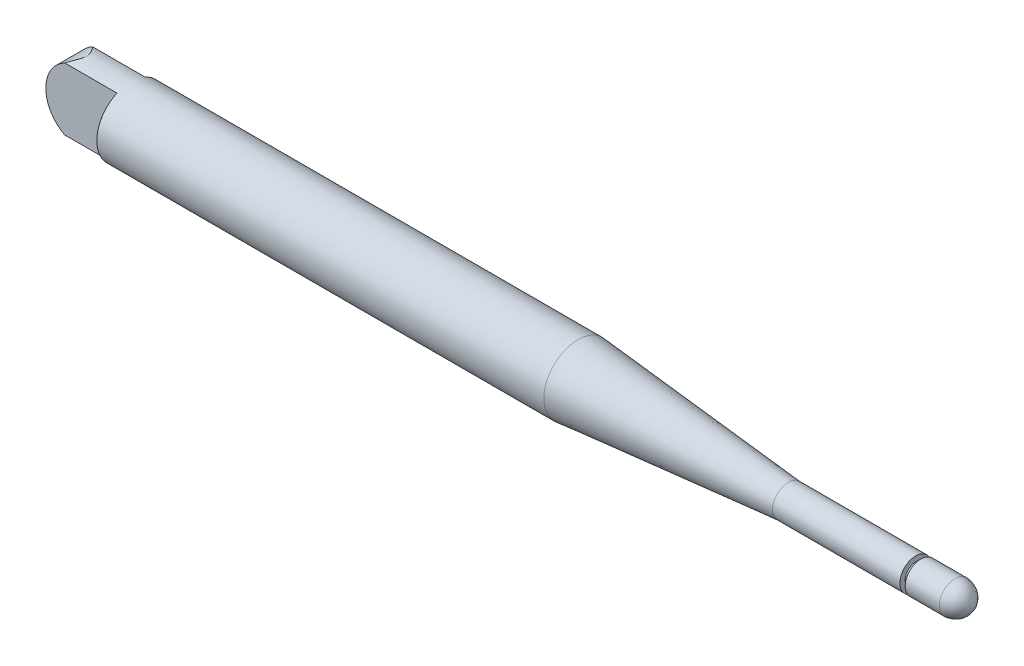
ISO-10303-21;
HEADER;
FILE_DESCRIPTION(('STEP AP214'),'2;1');
FILE_NAME('part.step','',(''),(''),'','','');
FILE_SCHEMA(('AUTOMOTIVE_DESIGN { 1 0 10303 214 1 1 1 1 }'));
ENDSEC;
DATA;
#1=APPLICATION_CONTEXT('core data for automotive mechanical design processes');
#2=APPLICATION_PROTOCOL_DEFINITION('international standard','automotive_design',2000,#1);
#3=PRODUCT_CONTEXT('',#1,'mechanical');
#4=PRODUCT('Part','Part','',(#3));
#5=PRODUCT_RELATED_PRODUCT_CATEGORY('part','',(#4));
#6=PRODUCT_DEFINITION_FORMATION('','',#4);
#7=PRODUCT_DEFINITION_CONTEXT('part definition',#1,'design');
#8=PRODUCT_DEFINITION('design','',#6,#7);
#9=PRODUCT_DEFINITION_SHAPE('','',#8);
#10=(LENGTH_UNIT() NAMED_UNIT(*) SI_UNIT(.MILLI.,.METRE.));
#11=(NAMED_UNIT(*) PLANE_ANGLE_UNIT() SI_UNIT($,.RADIAN.));
#12=(NAMED_UNIT(*) SI_UNIT($,.STERADIAN.) SOLID_ANGLE_UNIT());
#13=UNCERTAINTY_MEASURE_WITH_UNIT(LENGTH_MEASURE(1.E-05),#10,'distance_accuracy_value','');
#14=(GEOMETRIC_REPRESENTATION_CONTEXT(3) GLOBAL_UNCERTAINTY_ASSIGNED_CONTEXT((#13)) GLOBAL_UNIT_ASSIGNED_CONTEXT((#10,
#11,#12)) REPRESENTATION_CONTEXT('',''));
#15=CARTESIAN_POINT('',(0.,0.,0.));
#16=DIRECTION('',(0.,0.,1.));
#17=DIRECTION('',(1.,0.,0.));
#18=AXIS2_PLACEMENT_3D('',#15,#16,#17);
#19=CARTESIAN_POINT('',(-13.5,5.93134908875541,-2.65877753625991));
#20=DIRECTION('',(0.,0.,1.));
#21=DIRECTION('',(1.,0.,0.));
#22=AXIS2_PLACEMENT_3D('',#19,#20,#21);
#23=PLANE('',#22);
#24=DIRECTION('',(1.,0.,0.));
#25=VECTOR('',#24,1.);
#26=CARTESIAN_POINT('',(-13.5,-5.93134908875541,-2.65877753625991));
#27=LINE('',#26,#25);
#28=CARTESIAN_POINT('',(-9.96948914570237,-5.93134908875541,-2.65877753625991));
#29=VERTEX_POINT('',#28);
#30=CARTESIAN_POINT('',(0.,-5.93134908875541,-2.65877753625991));
#31=VERTEX_POINT('',#30);
#32=EDGE_CURVE('E114',#29,#31,#27,.T.);
#33=ORIENTED_EDGE('',*,*,#32,.F.);
#34=CARTESIAN_POINT('',(-6.84305441160065,-0.0116188090929386,-2.65877753625991));
#35=DIRECTION('',(0.,0.,1.));
#36=DIRECTION('',(1.,0.,0.));
#37=AXIS2_PLACEMENT_3D('',#34,#35,#36);
#38=CIRCLE('',#37,6.69460982661055);
#39=CARTESIAN_POINT('',(-13.5,-0.720756428769742,-2.65877753625991));
#40=VERTEX_POINT('',#39);
#41=EDGE_CURVE('E92',#29,#40,#38,.F.);
#42=ORIENTED_EDGE('',*,*,#41,.T.);
#43=DIRECTION('',(0.,-1.,0.));
#44=VECTOR('',#43,1.);
#45=CARTESIAN_POINT('',(-13.5,5.93134908875541,-2.65877753625991));
#46=LINE('',#45,#44);
#47=CARTESIAN_POINT('',(-13.5,0.697518810583865,-2.65877753625991));
#48=VERTEX_POINT('',#47);
#49=EDGE_CURVE('E154',#48,#40,#46,.T.);
#50=ORIENTED_EDGE('',*,*,#49,.F.);
#51=CARTESIAN_POINT('',(-9.92508836593899,5.93134908875541,-2.65877753625991));
#52=VERTEX_POINT('',#51);
#53=EDGE_CURVE('E58',#48,#52,#38,.F.);
#54=ORIENTED_EDGE('',*,*,#53,.T.);
#55=DIRECTION('',(1.,0.,0.));
#56=VECTOR('',#55,1.);
#57=CARTESIAN_POINT('',(-13.5,5.93134908875541,-2.65877753625991));
#58=LINE('',#57,#56);
#59=CARTESIAN_POINT('',(0.,5.93134908875541,-2.65877753625991));
#60=VERTEX_POINT('',#59);
#61=EDGE_CURVE('E117',#52,#60,#58,.T.);
#62=ORIENTED_EDGE('',*,*,#61,.T.);
#63=DIRECTION('',(0.,-1.,0.));
#64=VECTOR('',#63,1.);
#65=CARTESIAN_POINT('',(0.,5.93134908875541,-2.65877753625991));
#66=LINE('',#65,#64);
#67=EDGE_CURVE('E96',#60,#31,#66,.T.);
#68=ORIENTED_EDGE('',*,*,#67,.T.);
#69=EDGE_LOOP('',(#33,#42,#50,#54,#62,#68));
#70=FACE_BOUND('',#69,.T.);
#71=ADVANCED_FACE('F36',(#70),#23,.F.);
#72=CARTESIAN_POINT('',(-13.5,5.93134908875541,2.65877753625991));
#73=DIRECTION('',(0.,0.,-1.));
#74=DIRECTION('',(-1.,0.,0.));
#75=AXIS2_PLACEMENT_3D('',#72,#73,#74);
#76=PLANE('',#75);
#77=DIRECTION('',(0.,1.,0.));
#78=VECTOR('',#77,1.);
#79=CARTESIAN_POINT('',(-13.5,5.93134908875541,2.65877753625991));
#80=LINE('',#79,#78);
#81=CARTESIAN_POINT('',(-13.5,-0.720756428769742,2.65877753625991));
#82=VERTEX_POINT('',#81);
#83=CARTESIAN_POINT('',(-13.5,0.697518810583865,2.65877753625991));
#84=VERTEX_POINT('',#83);
#85=EDGE_CURVE('E106',#82,#84,#80,.T.);
#86=ORIENTED_EDGE('',*,*,#85,.F.);
#87=CARTESIAN_POINT('',(-6.84305441160065,-0.0116188090929386,2.65877753625991));
#88=DIRECTION('',(0.,0.,-1.));
#89=DIRECTION('',(1.,0.,0.));
#90=AXIS2_PLACEMENT_3D('',#87,#88,#89);
#91=CIRCLE('',#90,6.69460982661055);
#92=CARTESIAN_POINT('',(-9.96948914570237,-5.93134908875541,2.65877753625991));
#93=VERTEX_POINT('',#92);
#94=EDGE_CURVE('E50',#93,#82,#91,.T.);
#95=ORIENTED_EDGE('',*,*,#94,.F.);
#96=DIRECTION('',(1.,0.,0.));
#97=VECTOR('',#96,1.);
#98=CARTESIAN_POINT('',(-13.5,-5.93134908875541,2.65877753625991));
#99=LINE('',#98,#97);
#100=CARTESIAN_POINT('',(0.,-5.93134908875541,2.65877753625991));
#101=VERTEX_POINT('',#100);
#102=EDGE_CURVE('E102',#93,#101,#99,.T.);
#103=ORIENTED_EDGE('',*,*,#102,.T.);
#104=DIRECTION('',(0.,1.,0.));
#105=VECTOR('',#104,1.);
#106=CARTESIAN_POINT('',(0.,5.93134908875541,2.65877753625991));
#107=LINE('',#106,#105);
#108=CARTESIAN_POINT('',(0.,5.93134908875541,2.65877753625991));
#109=VERTEX_POINT('',#108);
#110=EDGE_CURVE('E152',#101,#109,#107,.T.);
#111=ORIENTED_EDGE('',*,*,#110,.T.);
#112=DIRECTION('',(1.,0.,0.));
#113=VECTOR('',#112,1.);
#114=CARTESIAN_POINT('',(-13.5,5.93134908875541,2.65877753625991));
#115=LINE('',#114,#113);
#116=CARTESIAN_POINT('',(-9.92508836593899,5.93134908875541,2.65877753625991));
#117=VERTEX_POINT('',#116);
#118=EDGE_CURVE('E115',#117,#109,#115,.T.);
#119=ORIENTED_EDGE('',*,*,#118,.F.);
#120=EDGE_CURVE('E107',#84,#117,#91,.T.);
#121=ORIENTED_EDGE('',*,*,#120,.F.);
#122=EDGE_LOOP('',(#86,#95,#103,#111,#119,#121));
#123=FACE_BOUND('',#122,.T.);
#124=ADVANCED_FACE('F100',(#123),#76,.F.);
#125=CARTESIAN_POINT('',(0.,0.,0.));
#126=DIRECTION('',(-1.,0.,0.));
#127=DIRECTION('',(0.,0.,1.));
#128=AXIS2_PLACEMENT_3D('',#125,#126,#127);
#129=PLANE('',#128);
#130=ORIENTED_EDGE('',*,*,#110,.F.);
#131=CARTESIAN_POINT('',(0.,0.,0.));
#132=DIRECTION('',(-1.,0.,0.));
#133=DIRECTION('',(0.,0.,1.));
#134=AXIS2_PLACEMENT_3D('',#131,#132,#133);
#135=CIRCLE('',#134,6.5);
#136=EDGE_CURVE('E113',#101,#109,#135,.T.);
#137=ORIENTED_EDGE('',*,*,#136,.T.);
#138=EDGE_LOOP('',(#130,#137));
#139=FACE_BOUND('',#138,.T.);
#140=ADVANCED_FACE('F184',(#139),#129,.T.);
#141=ORIENTED_EDGE('',*,*,#67,.F.);
#142=EDGE_CURVE('E144',#60,#31,#135,.T.);
#143=ORIENTED_EDGE('',*,*,#142,.T.);
#144=EDGE_LOOP('',(#141,#143));
#145=FACE_BOUND('',#144,.T.);
#146=ADVANCED_FACE('F38',(#145),#129,.T.);
#147=CARTESIAN_POINT('',(0.,0.,0.));
#148=DIRECTION('',(-1.,0.,0.));
#149=DIRECTION('',(0.,0.,1.));
#150=AXIS2_PLACEMENT_3D('',#147,#148,#149);
#151=CYLINDRICAL_SURFACE('',#150,6.5);
#152=CARTESIAN_POINT('',(-13.5,-0.720756428769742,-6.45991564731205));
#153=CARTESIAN_POINT('',(-13.4833574139441,-0.877342532267539,-6.44248218625441));
#154=CARTESIAN_POINT('',(-13.461191347965,-1.03263538821568,-6.41935608392167));
#155=CARTESIAN_POINT('',(-13.4065430399751,-1.33920836519285,-6.36244181702825));
#156=CARTESIAN_POINT('',(-13.3740737638005,-1.4904932720678,-6.32866705336982));
#157=CARTESIAN_POINT('',(-13.2998538947807,-1.78662912695314,-6.25149471674544));
#158=CARTESIAN_POINT('',(-13.2581931042841,-1.93152707361161,-6.20819026000292));
#159=CARTESIAN_POINT('',(-13.1662620898384,-2.21551154243796,-6.11260803921326));
#160=CARTESIAN_POINT('',(-13.1159894162341,-2.35459639702643,-6.06032772196795));
#161=CARTESIAN_POINT('',(-12.9541052172634,-2.76068327837173,-5.89186676166285));
#162=CARTESIAN_POINT('',(-12.8309828151993,-3.01822895862794,-5.76360494067673));
#163=CARTESIAN_POINT('',(-12.5605858404299,-3.50527130598998,-5.48112474872881));
#164=CARTESIAN_POINT('',(-12.4132534551716,-3.7346984800383,-5.32684422226666));
#165=CARTESIAN_POINT('',(-12.1387192822587,-4.11211952931791,-5.03808752415199));
#166=CARTESIAN_POINT('',(-12.0153663451483,-4.26633035371224,-4.90795269058228));
#167=CARTESIAN_POINT('',(-11.7604353579328,-4.55857190935269,-4.63778458124256));
#168=CARTESIAN_POINT('',(-11.6288532754372,-4.69659461143644,-4.49774644825907));
#169=CARTESIAN_POINT('',(-11.3590315742956,-4.95722793453934,-4.20878619776122));
#170=CARTESIAN_POINT('',(-11.2207714292513,-5.07978622234732,-4.0598363026082));
#171=CARTESIAN_POINT('',(-10.9398641211509,-5.30943421001304,-3.7545158029024));
#172=CARTESIAN_POINT('',(-10.7972185169717,-5.41652933110621,-3.59814782472558));
#173=CARTESIAN_POINT('',(-10.5048102139539,-5.61892857236999,-3.27343897059948));
#174=CARTESIAN_POINT('',(-10.354964727587,-5.71375639793204,-3.10487626419305));
#175=CARTESIAN_POINT('',(-10.0547993084868,-5.88806764260359,-2.76007718778379));
#176=CARTESIAN_POINT('',(-9.90447904432438,-5.96753499353082,-2.58383301598556));
#177=CARTESIAN_POINT('',(-9.60762943322177,-6.11094766764369,-2.22347978241912));
#178=CARTESIAN_POINT('',(-9.46108550919085,-6.1749646891852,-2.03941190151415));
#179=CARTESIAN_POINT('',(-9.24881886352254,-6.25949361085923,-1.7545580334254));
#180=CARTESIAN_POINT('',(-9.17937802872866,-6.28573616714255,-1.65823469336782));
#181=CARTESIAN_POINT('',(-9.04457741014358,-6.33429275028215,-1.46184064397268));
#182=CARTESIAN_POINT('',(-8.97921566783246,-6.35660867196954,-1.3617717705034));
#183=CARTESIAN_POINT('',(-8.8522975284675,-6.39796164963985,-1.15237970995169));
#184=CARTESIAN_POINT('',(-8.79102711064175,-6.41681562792738,-1.04284351448902));
#185=CARTESIAN_POINT('',(-8.68034621107941,-6.44943470873333,-0.817157132481939));
#186=CARTESIAN_POINT('',(-8.63091505590833,-6.46320870484482,-0.701018919692731));
#187=CARTESIAN_POINT('',(-8.56033973235016,-6.48230514098445,-0.488270780801292));
#188=CARTESIAN_POINT('',(-8.53534238302397,-6.48882854947356,-0.39309888694785));
#189=CARTESIAN_POINT('',(-8.50126084230208,-6.49764130574462,-0.199860651347355));
#190=CARTESIAN_POINT('',(-8.49213092916482,-6.49994281990864,-0.10180345666143));
#191=CARTESIAN_POINT('',(-8.49168793579718,-6.50005523360001,0.0946824369122902));
#192=CARTESIAN_POINT('',(-8.50043379519217,-6.49785127778132,0.193111293231935));
#193=CARTESIAN_POINT('',(-8.53394225076858,-6.48919401502874,0.387108362233885));
#194=CARTESIAN_POINT('',(-8.55874964205035,-6.4827288227316,0.482667789840947));
#195=CARTESIAN_POINT('',(-8.6407830883924,-6.46054857600871,0.732070546363559));
#196=CARTESIAN_POINT('',(-8.70859269485106,-6.44153771462461,0.881992215006683));
#197=CARTESIAN_POINT('',(-8.86160931486129,-6.39517032569552,1.17201101377891));
#198=CARTESIAN_POINT('',(-8.94695137805289,-6.36774814589336,1.31201979507365));
#199=CARTESIAN_POINT('',(-9.10905044957101,-6.3115375609833,1.55790868952708));
#200=CARTESIAN_POINT('',(-9.18425113138419,-6.28405110506411,1.66513223692138));
#201=CARTESIAN_POINT('',(-9.33817131525102,-6.22442873982716,1.87576199831366));
#202=CARTESIAN_POINT('',(-9.41689289313456,-6.19229006202891,1.97916589296614));
#203=CARTESIAN_POINT('',(-9.57413951699357,-6.12440087183066,2.18005675051197));
#204=CARTESIAN_POINT('',(-9.65261051549637,-6.08877388418434,2.27762822528474));
#205=CARTESIAN_POINT('',(-9.81051155553871,-6.01326006216938,2.47008433270524));
#206=CARTESIAN_POINT('',(-9.88994019749522,-5.97337890136809,2.56497233555501));
#207=CARTESIAN_POINT('',(-9.96948914570237,-5.93134908875541,2.65877753625991));
#208=B_SPLINE_CURVE_WITH_KNOTS('',3,(#152,#153,#154,#155,#156,#157,#158,#159,#160,#161,#162,
#163,#164,#165,#166,#167,#168,#169,#170,#171,#172,#173,#174,#175,#176,#177,#178,#179,#180,#181,
#182,#183,#184,#185,#186,#187,#188,#189,#190,#191,#192,#193,#194,#195,#196,#197,#198,#199,#200,
#201,#202,#203,#204,#205,#206,#207),.UNSPECIFIED.,.F.,.F.,(4,2,2,2,2,2,2,2,2,2,2,2,2,2,2,2,2,2,
2,2,2,2,2,2,2,2,2,4),(0.,0.4749841250187,0.949372872054181,1.41931728201422,1.88939559057704,
2.82414047091741,3.76115082089705,4.46972741456139,5.17865398273491,5.88991871763712,
6.60093348140333,7.3342919874868,8.06841353719125,8.79905985489168,9.16375601889724,
9.52827571010563,9.90852751612461,10.2881104140697,10.5828420109609,10.8767229270358,
11.1715743841662,11.4672517356862,11.961351351152,12.4594101307237,12.8606448955307,
13.2621194193966,13.6525612737943,14.0424887768536),.UNSPECIFIED.);
#209=EDGE_CURVE('E89',#29,#93,#208,.T.);
#210=ORIENTED_EDGE('',*,*,#209,.F.);
#211=ORIENTED_EDGE('',*,*,#32,.T.);
#212=ORIENTED_EDGE('',*,*,#142,.F.);
#213=ORIENTED_EDGE('',*,*,#61,.F.);
#214=CARTESIAN_POINT('',(-9.92508836593899,5.93134908875541,2.65877753625991));
#215=CARTESIAN_POINT('',(-9.85671292348471,5.96681636021047,2.57963481898652));
#216=CARTESIAN_POINT('',(-9.78840151338825,6.00073771015612,2.49973758988183));
#217=CARTESIAN_POINT('',(-9.65230131198956,6.06551807566918,2.33818255714987));
#218=CARTESIAN_POINT('',(-9.58451287043944,6.09637518226162,2.25652369413028));
#219=CARTESIAN_POINT('',(-9.44741394778315,6.15611286774104,2.08819114884717));
#220=CARTESIAN_POINT('',(-9.37814180766937,6.18487582567783,2.00144427170551));
#221=CARTESIAN_POINT('',(-9.24143088968299,6.23906041802107,1.82553994863958));
#222=CARTESIAN_POINT('',(-9.17399145910746,6.26448325468608,1.73638338407857));
#223=CARTESIAN_POINT('',(-9.041850098706,6.31199040462743,1.55486415429496));
#224=CARTESIAN_POINT('',(-8.97715449569506,6.33406727523216,1.46249488766524));
#225=CARTESIAN_POINT('',(-8.85228359980124,6.3747030176551,1.27377221771096));
#226=CARTESIAN_POINT('',(-8.792114294868,6.393257277079,1.17741378934731));
#227=CARTESIAN_POINT('',(-8.68011195365303,6.42626644686269,0.981246376852074));
#228=CARTESIAN_POINT('',(-8.62816286006784,6.44078114848243,0.881515326893915));
#229=CARTESIAN_POINT('',(-8.53613100818916,6.46553775045348,0.676346257730498));
#230=CARTESIAN_POINT('',(-8.49601078424326,6.47579318432097,0.570927536012986));
#231=CARTESIAN_POINT('',(-8.43745355857997,6.49042216965754,0.365771649587439));
#232=CARTESIAN_POINT('',(-8.41715564682045,6.49530770797471,0.266633679853889));
#233=CARTESIAN_POINT('',(-8.3958660615502,6.50042615736428,0.066385509379679));
#234=CARTESIAN_POINT('',(-8.39480475448869,6.50067584956661,-0.0347162512022525));
#235=CARTESIAN_POINT('',(-8.41206970297054,6.49653295301532,-0.234659270652029));
#236=CARTESIAN_POINT('',(-8.43032823117686,6.49215658137897,-0.333507193470939));
#237=CARTESIAN_POINT('',(-8.48201563360676,6.47932049965928,-0.527180368644672));
#238=CARTESIAN_POINT('',(-8.5155255479244,6.47083896079417,-0.621981134203031));
#239=CARTESIAN_POINT('',(-8.60205672417196,6.44795860582951,-0.828942164051649));
#240=CARTESIAN_POINT('',(-8.65783088788244,6.43262799147697,-0.939805310079355));
#241=CARTESIAN_POINT('',(-8.77866908646175,6.39737403076509,-1.15567748802153));
#242=CARTESIAN_POINT('',(-8.84375319495225,6.37744070169981,-1.2606731703069));
#243=CARTESIAN_POINT('',(-8.97980028295276,6.33324310819516,-1.46669136702389));
#244=CARTESIAN_POINT('',(-9.05079557856211,6.30895406817486,-1.56768689051023));
#245=CARTESIAN_POINT('',(-9.19605620914017,6.25632794566407,-1.76603294430997));
#246=CARTESIAN_POINT('',(-9.27031861655862,6.22799443815943,-1.86338659883515));
#247=CARTESIAN_POINT('',(-9.42890235453696,6.16408046750961,-2.06555677310216));
#248=CARTESIAN_POINT('',(-9.51344825332077,6.12804866768953,-2.17005376966338));
#249=CARTESIAN_POINT('',(-9.68381813312982,6.05110467894696,-2.37617805097715));
#250=CARTESIAN_POINT('',(-9.76964231890811,6.01019170064858,-2.4778048682738));
#251=CARTESIAN_POINT('',(-10.0279463012078,5.88001981945072,-2.77908901044855));
#252=CARTESIAN_POINT('',(-10.2011407540946,5.78337398067507,-2.97500547192195));
#253=CARTESIAN_POINT('',(-10.5445954115343,5.57024493243728,-3.35708253255247));
#254=CARTESIAN_POINT('',(-10.7148632398031,5.45382627776121,-3.54327237983562));
#255=CARTESIAN_POINT('',(-11.0500191674828,5.20023072127536,-3.90596043461907));
#256=CARTESIAN_POINT('',(-11.2149106588243,5.06306722796152,-4.0824648026548));
#257=CARTESIAN_POINT('',(-11.4923885518717,4.80778093776737,-4.37745464252362));
#258=CARTESIAN_POINT('',(-11.6069017116442,4.69477615302766,-4.49856016857616));
#259=CARTESIAN_POINT('',(-11.8305076082356,4.45713426837496,-4.7341282611469));
#260=CARTESIAN_POINT('',(-11.9396002002422,4.33249685794824,-4.84859065020519));
#261=CARTESIAN_POINT('',(-12.2567813381231,3.94085487705583,-5.18040525636294));
#262=CARTESIAN_POINT('',(-12.4551426701006,3.65578945797069,-5.38657556349403));
#263=CARTESIAN_POINT('',(-12.7742608196918,3.10549117686806,-5.71708829802105));
#264=CARTESIAN_POINT('',(-12.9025072722358,2.84949663878386,-5.84947005271382));
#265=CARTESIAN_POINT('',(-13.0719532449239,2.44599911163857,-6.02399752651443));
#266=CARTESIAN_POINT('',(-13.124578434706,2.30837837105253,-6.07812880940459));
#267=CARTESIAN_POINT('',(-13.2213979975415,2.02716308901645,-6.17760781705837));
#268=CARTESIAN_POINT('',(-13.2655955608314,1.88357083322751,-6.22295886563658));
#269=CARTESIAN_POINT('',(-13.3504800703047,1.56991917328923,-6.30995309844811));
#270=CARTESIAN_POINT('',(-13.3897271067787,1.39904256309351,-6.35010346745325));
#271=CARTESIAN_POINT('',(-13.4386793040736,1.13875948512744,-6.40008398128883));
#272=CARTESIAN_POINT('',(-13.4533560044251,1.05122291504527,-6.41504916530951));
#273=CARTESIAN_POINT('',(-13.4792775284072,0.87509994042683,-6.44143870103583));
#274=CARTESIAN_POINT('',(-13.4905217904153,0.786513366547494,-6.45286247329319));
#275=CARTESIAN_POINT('',(-13.5,0.697518810583865,-6.46246605475663));
#276=B_SPLINE_CURVE_WITH_KNOTS('',3,(#214,#215,#216,#217,#218,#219,#220,#221,#222,#223,#224,
#225,#226,#227,#228,#229,#230,#231,#232,#233,#234,#235,#236,#237,#238,#239,#240,#241,#242,#243,
#244,#245,#246,#247,#248,#249,#250,#251,#252,#253,#254,#255,#256,#257,#258,#259,#260,#261,#262,
#263,#264,#265,#266,#267,#268,#269,#270,#271,#272,#273,#274,#275),.UNSPECIFIED.,.F.,.F.,(4,2,2,
2,2,2,2,2,2,2,2,2,2,2,2,2,2,2,2,2,2,2,2,2,2,2,2,2,2,2,4),(0.,0.331309384196032,
0.662823890807796,1.00677856157602,1.35060908654403,1.69519353469099,2.04022610511065,
2.37984118155672,2.71836874366604,3.02067019382727,3.32187713980379,3.62203166638325,
3.92380006444767,4.29802368091551,4.6730666941267,5.05031485623698,5.42723160259427,
5.84457544990723,6.261986881077,7.09738241709733,7.93010119385113,8.76228402224423,
9.36589398219188,9.96952005912092,11.1748959500264,12.1173341078008,12.5877277420625,
13.0579429560848,13.5963859149071,13.866296742521,14.136251709852),.UNSPECIFIED.);
#277=EDGE_CURVE('E164',#117,#52,#276,.T.);
#278=ORIENTED_EDGE('',*,*,#277,.F.);
#279=ORIENTED_EDGE('',*,*,#118,.T.);
#280=ORIENTED_EDGE('',*,*,#136,.F.);
#281=ORIENTED_EDGE('',*,*,#102,.F.);
#282=EDGE_LOOP('',(#210,#211,#212,#213,#278,#279,#280,#281));
#283=FACE_BOUND('',#282,.T.);
#284=CARTESIAN_POINT('',(85.,0.,0.));
#285=DIRECTION('',(-1.,0.,0.));
#286=DIRECTION('',(0.,0.,1.));
#287=AXIS2_PLACEMENT_3D('',#284,#285,#286);
#288=CIRCLE('',#287,6.5);
#289=CARTESIAN_POINT('',(85.,0.,6.5));
#290=VERTEX_POINT('',#289);
#291=EDGE_CURVE('E141',#290,#290,#288,.T.);
#292=ORIENTED_EDGE('',*,*,#291,.T.);
#293=EDGE_LOOP('',(#292));
#294=FACE_BOUND('',#293,.T.);
#295=ADVANCED_FACE('F110',(#283,#294),#151,.T.);
#296=CARTESIAN_POINT('',(85.,0.,0.));
#297=DIRECTION('',(-1.,0.,0.));
#298=DIRECTION('',(0.,0.,1.));
#299=AXIS2_PLACEMENT_3D('',#296,#297,#298);
#300=CONICAL_SURFACE('',#299,6.5,0.0872777129494614);
#301=CARTESIAN_POINT('',(125.,0.,0.));
#302=DIRECTION('',(-1.,0.,0.));
#303=DIRECTION('',(0.,0.,1.));
#304=AXIS2_PLACEMENT_3D('',#301,#302,#303);
#305=CIRCLE('',#304,3.);
#306=CARTESIAN_POINT('',(125.,0.,3.));
#307=VERTEX_POINT('',#306);
#308=EDGE_CURVE('E138',#307,#307,#305,.T.);
#309=ORIENTED_EDGE('',*,*,#308,.T.);
#310=EDGE_LOOP('',(#309));
#311=FACE_BOUND('',#310,.T.);
#312=ORIENTED_EDGE('',*,*,#291,.F.);
#313=EDGE_LOOP('',(#312));
#314=FACE_BOUND('',#313,.T.);
#315=ADVANCED_FACE('F208',(#311,#314),#300,.T.);
#316=CARTESIAN_POINT('',(0.,0.,0.));
#317=DIRECTION('',(-1.,0.,0.));
#318=DIRECTION('',(0.,0.,1.));
#319=AXIS2_PLACEMENT_3D('',#316,#317,#318);
#320=CYLINDRICAL_SURFACE('',#319,3.);
#321=CARTESIAN_POINT('',(149.222035298061,0.,0.));
#322=DIRECTION('',(-1.,0.,0.));
#323=DIRECTION('',(0.,0.,1.));
#324=AXIS2_PLACEMENT_3D('',#321,#322,#323);
#325=CIRCLE('',#324,3.);
#326=CARTESIAN_POINT('',(149.222035298061,0.,3.));
#327=VERTEX_POINT('',#326);
#328=EDGE_CURVE('E135',#327,#327,#325,.T.);
#329=ORIENTED_EDGE('',*,*,#328,.T.);
#330=EDGE_LOOP('',(#329));
#331=FACE_BOUND('',#330,.T.);
#332=ORIENTED_EDGE('',*,*,#308,.F.);
#333=EDGE_LOOP('',(#332));
#334=FACE_BOUND('',#333,.T.);
#335=ADVANCED_FACE('F205',(#331,#334),#320,.T.);
#336=CARTESIAN_POINT('',(149.222035298061,-3.,0.));
#337=DIRECTION('',(1.,0.,0.));
#338=DIRECTION('',(0.,0.,-1.));
#339=AXIS2_PLACEMENT_3D('',#336,#337,#338);
#340=PLANE('',#339);
#341=CARTESIAN_POINT('',(149.222035298061,0.,0.));
#342=DIRECTION('',(-1.,0.,0.));
#343=DIRECTION('',(0.,0.,1.));
#344=AXIS2_PLACEMENT_3D('',#341,#342,#343);
#345=CIRCLE('',#344,2.);
#346=CARTESIAN_POINT('',(149.222035298061,0.,2.));
#347=VERTEX_POINT('',#346);
#348=EDGE_CURVE('E132',#347,#347,#345,.T.);
#349=ORIENTED_EDGE('',*,*,#348,.T.);
#350=EDGE_LOOP('',(#349));
#351=FACE_BOUND('',#350,.T.);
#352=ORIENTED_EDGE('',*,*,#328,.F.);
#353=EDGE_LOOP('',(#352));
#354=FACE_BOUND('',#353,.T.);
#355=ADVANCED_FACE('F201',(#351,#354),#340,.T.);
#356=CARTESIAN_POINT('',(0.,0.,0.));
#357=DIRECTION('',(-1.,0.,0.));
#358=DIRECTION('',(0.,0.,1.));
#359=AXIS2_PLACEMENT_3D('',#356,#357,#358);
#360=CYLINDRICAL_SURFACE('',#359,2.);
#361=CARTESIAN_POINT('',(150.222035298061,0.,0.));
#362=DIRECTION('',(-1.,0.,0.));
#363=DIRECTION('',(0.,0.,1.));
#364=AXIS2_PLACEMENT_3D('',#361,#362,#363);
#365=CIRCLE('',#364,2.);
#366=CARTESIAN_POINT('',(150.222035298061,0.,2.));
#367=VERTEX_POINT('',#366);
#368=EDGE_CURVE('E129',#367,#367,#365,.T.);
#369=ORIENTED_EDGE('',*,*,#368,.T.);
#370=EDGE_LOOP('',(#369));
#371=FACE_BOUND('',#370,.T.);
#372=ORIENTED_EDGE('',*,*,#348,.F.);
#373=EDGE_LOOP('',(#372));
#374=FACE_BOUND('',#373,.T.);
#375=ADVANCED_FACE('F197',(#371,#374),#360,.T.);
#376=CARTESIAN_POINT('',(150.222035298061,-2.,0.));
#377=DIRECTION('',(-1.,0.,0.));
#378=DIRECTION('',(0.,0.,1.));
#379=AXIS2_PLACEMENT_3D('',#376,#377,#378);
#380=PLANE('',#379);
#381=CARTESIAN_POINT('',(150.222035298061,0.,0.));
#382=DIRECTION('',(-1.,0.,0.));
#383=DIRECTION('',(0.,0.,1.));
#384=AXIS2_PLACEMENT_3D('',#381,#382,#383);
#385=CIRCLE('',#384,3.);
#386=CARTESIAN_POINT('',(150.222035298061,0.,3.));
#387=VERTEX_POINT('',#386);
#388=EDGE_CURVE('E126',#387,#387,#385,.T.);
#389=ORIENTED_EDGE('',*,*,#388,.T.);
#390=EDGE_LOOP('',(#389));
#391=FACE_BOUND('',#390,.T.);
#392=ORIENTED_EDGE('',*,*,#368,.F.);
#393=EDGE_LOOP('',(#392));
#394=FACE_BOUND('',#393,.T.);
#395=ADVANCED_FACE('F193',(#391,#394),#380,.T.);
#396=CARTESIAN_POINT('',(0.,0.,0.));
#397=DIRECTION('',(-1.,0.,0.));
#398=DIRECTION('',(0.,0.,1.));
#399=AXIS2_PLACEMENT_3D('',#396,#397,#398);
#400=CYLINDRICAL_SURFACE('',#399,3.);
#401=CARTESIAN_POINT('',(156.707023178701,0.,0.));
#402=DIRECTION('',(-1.,0.,0.));
#403=DIRECTION('',(0.,0.,1.));
#404=AXIS2_PLACEMENT_3D('',#401,#402,#403);
#405=CIRCLE('',#404,3.);
#406=CARTESIAN_POINT('',(156.707023178701,0.,3.));
#407=VERTEX_POINT('',#406);
#408=EDGE_CURVE('E123',#407,#407,#405,.T.);
#409=ORIENTED_EDGE('',*,*,#408,.T.);
#410=EDGE_LOOP('',(#409));
#411=FACE_BOUND('',#410,.T.);
#412=ORIENTED_EDGE('',*,*,#388,.F.);
#413=EDGE_LOOP('',(#412));
#414=FACE_BOUND('',#413,.T.);
#415=ADVANCED_FACE('F189',(#411,#414),#400,.T.);
#416=CARTESIAN_POINT('',(156.707023178701,0.,-0.307282724268415));
#417=DIRECTION('',(0.,-1.,0.));
#418=DIRECTION('',(0.,0.,1.));
#419=AXIS2_PLACEMENT_3D('',#416,#417,#418);
#420=CIRCLE('',#419,3.30728272426841);
#421=TRIMMED_CURVE('',#420,(PARAMETER_VALUE(-1.47775119693885)),
(PARAMETER_VALUE(1.47775119693885)),.T.,.PARAMETER.);
#422=CARTESIAN_POINT('',(156.707023178701,0.,0.));
#423=DIRECTION('',(-1.,0.,0.));
#424=AXIS1_PLACEMENT('',#422,#423);
#425=SURFACE_OF_REVOLUTION('',#421,#424);
#426=CARTESIAN_POINT('',(160.,0.,0.));
#427=VERTEX_POINT('',#426);
#428=VERTEX_LOOP('',#427);
#429=FACE_BOUND('',#428,.T.);
#430=ORIENTED_EDGE('',*,*,#408,.F.);
#431=EDGE_LOOP('',(#430));
#432=FACE_BOUND('',#431,.T.);
#433=ADVANCED_FACE('F180',(#429,#432),#425,.T.);
#434=CARTESIAN_POINT('',(-13.5,0.,0.));
#435=DIRECTION('',(-1.,0.,0.));
#436=DIRECTION('',(0.,0.,1.));
#437=AXIS2_PLACEMENT_3D('',#434,#435,#436);
#438=PLANE('',#437);
#439=DIRECTION('',(0.,0.,1.));
#440=VECTOR('',#439,1.);
#441=CARTESIAN_POINT('',(-13.5,-0.720756428769742,-10.8412224637401));
#442=LINE('',#441,#440);
#443=EDGE_CURVE('E11',#82,#40,#442,.F.);
#444=ORIENTED_EDGE('',*,*,#443,.F.);
#445=ORIENTED_EDGE('',*,*,#85,.T.);
#446=DIRECTION('',(0.,0.,1.));
#447=VECTOR('',#446,1.);
#448=CARTESIAN_POINT('',(-13.5,0.697518810583865,-10.8412224637401));
#449=LINE('',#448,#447);
#450=EDGE_CURVE('E44',#48,#84,#449,.T.);
#451=ORIENTED_EDGE('',*,*,#450,.F.);
#452=ORIENTED_EDGE('',*,*,#49,.T.);
#453=EDGE_LOOP('',(#444,#445,#451,#452));
#454=FACE_BOUND('',#453,.T.);
#455=ADVANCED_FACE('F176',(#454),#438,.T.);
#456=CARTESIAN_POINT('',(-6.84305441160065,-0.0116188090929386,-10.8412224637401));
#457=DIRECTION('',(0.,0.,1.));
#458=DIRECTION('',(1.,0.,0.));
#459=AXIS2_PLACEMENT_3D('',#456,#457,#458);
#460=CYLINDRICAL_SURFACE('',#459,6.69460982661055);
#461=ORIENTED_EDGE('',*,*,#277,.T.);
#462=ORIENTED_EDGE('',*,*,#53,.F.);
#463=ORIENTED_EDGE('',*,*,#450,.T.);
#464=ORIENTED_EDGE('',*,*,#120,.T.);
#465=EDGE_LOOP('',(#461,#462,#463,#464));
#466=FACE_BOUND('',#465,.T.);
#467=ADVANCED_FACE('F172',(#466),#460,.T.);
#468=ORIENTED_EDGE('',*,*,#209,.T.);
#469=ORIENTED_EDGE('',*,*,#94,.T.);
#470=ORIENTED_EDGE('',*,*,#443,.T.);
#471=ORIENTED_EDGE('',*,*,#41,.F.);
#472=EDGE_LOOP('',(#468,#469,#470,#471));
#473=FACE_BOUND('',#472,.T.);
#474=ADVANCED_FACE('F90',(#473),#460,.T.);
#475=CLOSED_SHELL('',(#71,#124,#140,#146,#295,#315,#335,#355,#375,#395,#415,#433,#455,#467,#474));
#476=MANIFOLD_SOLID_BREP('B2',#475);
#477=ADVANCED_BREP_SHAPE_REPRESENTATION('',(#18,#476),#14);
#478=SHAPE_DEFINITION_REPRESENTATION(#9,#477);
ENDSEC;
END-ISO-10303-21;
